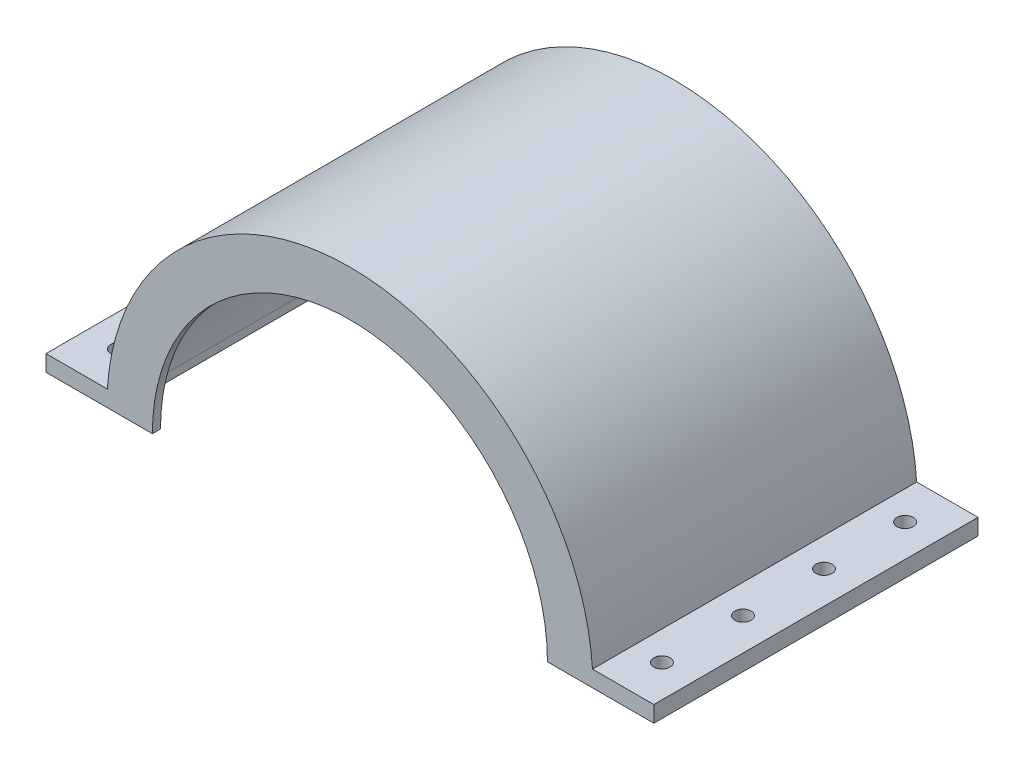
ISO-10303-21;
HEADER;
FILE_DESCRIPTION(('STEP AP214'),'2;1');
FILE_NAME('part.step','',(''),(''),'','','');
FILE_SCHEMA(('AUTOMOTIVE_DESIGN { 1 0 10303 214 1 1 1 1 }'));
ENDSEC;
DATA;
#1=APPLICATION_CONTEXT('core data for automotive mechanical design processes');
#2=APPLICATION_PROTOCOL_DEFINITION('international standard','automotive_design',2000,#1);
#3=PRODUCT_CONTEXT('',#1,'mechanical');
#4=PRODUCT('Part','Part','',(#3));
#5=PRODUCT_RELATED_PRODUCT_CATEGORY('part','',(#4));
#6=PRODUCT_DEFINITION_FORMATION('','',#4);
#7=PRODUCT_DEFINITION_CONTEXT('part definition',#1,'design');
#8=PRODUCT_DEFINITION('design','',#6,#7);
#9=PRODUCT_DEFINITION_SHAPE('','',#8);
#10=(LENGTH_UNIT() NAMED_UNIT(*) SI_UNIT(.MILLI.,.METRE.));
#11=(NAMED_UNIT(*) PLANE_ANGLE_UNIT() SI_UNIT($,.RADIAN.));
#12=(NAMED_UNIT(*) SI_UNIT($,.STERADIAN.) SOLID_ANGLE_UNIT());
#13=UNCERTAINTY_MEASURE_WITH_UNIT(LENGTH_MEASURE(1.E-05),#10,'distance_accuracy_value','');
#14=(GEOMETRIC_REPRESENTATION_CONTEXT(3) GLOBAL_UNCERTAINTY_ASSIGNED_CONTEXT((#13)) GLOBAL_UNIT_ASSIGNED_CONTEXT((#10,
#11,#12)) REPRESENTATION_CONTEXT('',''));
#15=CARTESIAN_POINT('',(0.,0.,0.));
#16=DIRECTION('',(0.,0.,1.));
#17=DIRECTION('',(1.,0.,0.));
#18=AXIS2_PLACEMENT_3D('',#15,#16,#17);
#19=CARTESIAN_POINT('',(-75.,0.,80.));
#20=DIRECTION('',(0.,1.,0.));
#21=DIRECTION('',(0.,0.,1.));
#22=AXIS2_PLACEMENT_3D('',#19,#20,#21);
#23=PLANE('',#22);
#24=CARTESIAN_POINT('',(-67.,0.,30.));
#25=DIRECTION('',(0.,1.,0.));
#26=DIRECTION('',(0.,0.,-1.));
#27=AXIS2_PLACEMENT_3D('',#24,#25,#26);
#28=CIRCLE('',#27,2.);
#29=CARTESIAN_POINT('',(-67.,0.,28.));
#30=VERTEX_POINT('',#29);
#31=EDGE_CURVE('E246',#30,#30,#28,.T.);
#32=ORIENTED_EDGE('',*,*,#31,.T.);
#33=EDGE_LOOP('',(#32));
#34=FACE_BOUND('',#33,.T.);
#35=CARTESIAN_POINT('',(-67.,0.,70.));
#36=DIRECTION('',(0.,1.,0.));
#37=DIRECTION('',(0.,0.,-1.));
#38=AXIS2_PLACEMENT_3D('',#35,#36,#37);
#39=CIRCLE('',#38,2.);
#40=CARTESIAN_POINT('',(-67.,0.,68.));
#41=VERTEX_POINT('',#40);
#42=EDGE_CURVE('E240',#41,#41,#39,.T.);
#43=ORIENTED_EDGE('',*,*,#42,.T.);
#44=EDGE_LOOP('',(#43));
#45=FACE_BOUND('',#44,.T.);
#46=DIRECTION('',(1.,0.,0.));
#47=VECTOR('',#46,1.);
#48=CARTESIAN_POINT('',(-75.,0.,0.));
#49=LINE('',#48,#47);
#50=CARTESIAN_POINT('',(-75.,0.,0.));
#51=VERTEX_POINT('',#50);
#52=CARTESIAN_POINT('',(-15.,0.,0.));
#53=VERTEX_POINT('',#52);
#54=EDGE_CURVE('E198',#51,#53,#49,.T.);
#55=ORIENTED_EDGE('',*,*,#54,.T.);
#56=DIRECTION('',(0.,0.,-1.));
#57=VECTOR('',#56,1.);
#58=CARTESIAN_POINT('',(-15.,0.,80.001));
#59=LINE('',#58,#57);
#60=CARTESIAN_POINT('',(-15.,0.,2.));
#61=VERTEX_POINT('',#60);
#62=EDGE_CURVE('E49',#61,#53,#59,.T.);
#63=ORIENTED_EDGE('',*,*,#62,.F.);
#64=DIRECTION('',(1.,0.,0.));
#65=VECTOR('',#64,1.);
#66=CARTESIAN_POINT('',(-75.,0.,2.));
#67=LINE('',#66,#65);
#68=CARTESIAN_POINT('',(-57.9655069847577,0.,2.));
#69=VERTEX_POINT('',#68);
#70=EDGE_CURVE('E154',#69,#61,#67,.T.);
#71=ORIENTED_EDGE('',*,*,#70,.F.);
#72=DIRECTION('',(0.,0.,-1.));
#73=VECTOR('',#72,1.);
#74=CARTESIAN_POINT('',(-57.9655069847577,0.,78.));
#75=LINE('',#74,#73);
#76=CARTESIAN_POINT('',(-57.9655069847577,0.,78.));
#77=VERTEX_POINT('',#76);
#78=EDGE_CURVE('E162',#77,#69,#75,.T.);
#79=ORIENTED_EDGE('',*,*,#78,.F.);
#80=DIRECTION('',(1.,0.,0.));
#81=VECTOR('',#80,1.);
#82=CARTESIAN_POINT('',(-75.,0.,78.));
#83=LINE('',#82,#81);
#84=CARTESIAN_POINT('',(-48.75,0.,78.));
#85=VERTEX_POINT('',#84);
#86=EDGE_CURVE('E172',#77,#85,#83,.T.);
#87=ORIENTED_EDGE('',*,*,#86,.T.);
#88=DIRECTION('',(0.,0.,1.));
#89=VECTOR('',#88,1.);
#90=CARTESIAN_POINT('',(-48.75,0.,-0.001000000000001));
#91=LINE('',#90,#89);
#92=CARTESIAN_POINT('',(-48.75,0.,80.));
#93=VERTEX_POINT('',#92);
#94=EDGE_CURVE('E269',#85,#93,#91,.T.);
#95=ORIENTED_EDGE('',*,*,#94,.T.);
#96=DIRECTION('',(1.,0.,0.));
#97=VECTOR('',#96,1.);
#98=CARTESIAN_POINT('',(-75.,0.,80.));
#99=LINE('',#98,#97);
#100=CARTESIAN_POINT('',(-75.,0.,80.));
#101=VERTEX_POINT('',#100);
#102=EDGE_CURVE('E182',#101,#93,#99,.T.);
#103=ORIENTED_EDGE('',*,*,#102,.F.);
#104=DIRECTION('',(0.,0.,-1.));
#105=VECTOR('',#104,1.);
#106=CARTESIAN_POINT('',(-75.,0.,80.));
#107=LINE('',#106,#105);
#108=EDGE_CURVE('E222',#101,#51,#107,.T.);
#109=ORIENTED_EDGE('',*,*,#108,.T.);
#110=EDGE_LOOP('',(#55,#63,#71,#79,#87,#95,#103,#109));
#111=FACE_BOUND('',#110,.T.);
#112=CARTESIAN_POINT('',(-67.,0.,50.));
#113=DIRECTION('',(0.,1.,0.));
#114=DIRECTION('',(0.,0.,-1.));
#115=AXIS2_PLACEMENT_3D('',#112,#113,#114);
#116=CIRCLE('',#115,2.);
#117=CARTESIAN_POINT('',(-67.,0.,48.));
#118=VERTEX_POINT('',#117);
#119=EDGE_CURVE('E243',#118,#118,#116,.T.);
#120=ORIENTED_EDGE('',*,*,#119,.T.);
#121=EDGE_LOOP('',(#120));
#122=FACE_BOUND('',#121,.T.);
#123=CARTESIAN_POINT('',(-67.,0.,10.));
#124=DIRECTION('',(0.,1.,0.));
#125=DIRECTION('',(0.,0.,-1.));
#126=AXIS2_PLACEMENT_3D('',#123,#124,#125);
#127=CIRCLE('',#126,2.);
#128=CARTESIAN_POINT('',(-67.,0.,8.00000000000001));
#129=VERTEX_POINT('',#128);
#130=EDGE_CURVE('E256',#129,#129,#127,.T.);
#131=ORIENTED_EDGE('',*,*,#130,.T.);
#132=EDGE_LOOP('',(#131));
#133=FACE_BOUND('',#132,.T.);
#134=ADVANCED_FACE('F32',(#34,#45,#111,#122,#133),#23,.F.);
#135=CARTESIAN_POINT('',(-75.,4.,80.));
#136=DIRECTION('',(0.,-1.,0.));
#137=DIRECTION('',(0.,0.,-1.));
#138=AXIS2_PLACEMENT_3D('',#135,#136,#137);
#139=PLANE('',#138);
#140=CARTESIAN_POINT('',(-67.,4.,30.));
#141=DIRECTION('',(0.,-1.,0.));
#142=DIRECTION('',(0.,0.,-1.));
#143=AXIS2_PLACEMENT_3D('',#140,#141,#142);
#144=CIRCLE('',#143,2.);
#145=CARTESIAN_POINT('',(-67.,4.,28.));
#146=VERTEX_POINT('',#145);
#147=EDGE_CURVE('E244',#146,#146,#144,.F.);
#148=ORIENTED_EDGE('',*,*,#147,.F.);
#149=EDGE_LOOP('',(#148));
#150=FACE_BOUND('',#149,.T.);
#151=CARTESIAN_POINT('',(-67.,4.,70.));
#152=DIRECTION('',(0.,-1.,0.));
#153=DIRECTION('',(0.,0.,-1.));
#154=AXIS2_PLACEMENT_3D('',#151,#152,#153);
#155=CIRCLE('',#154,2.);
#156=CARTESIAN_POINT('',(-67.,4.,68.));
#157=VERTEX_POINT('',#156);
#158=EDGE_CURVE('E236',#157,#157,#155,.F.);
#159=ORIENTED_EDGE('',*,*,#158,.F.);
#160=EDGE_LOOP('',(#159));
#161=FACE_BOUND('',#160,.T.);
#162=DIRECTION('',(-1.,0.,0.));
#163=VECTOR('',#162,1.);
#164=CARTESIAN_POINT('',(-75.,4.,0.));
#165=LINE('',#164,#163);
#166=CARTESIAN_POINT('',(-59.8665181883831,3.99999999999999,0.));
#167=VERTEX_POINT('',#166);
#168=CARTESIAN_POINT('',(-75.,4.,0.));
#169=VERTEX_POINT('',#168);
#170=EDGE_CURVE('E181',#167,#169,#165,.T.);
#171=ORIENTED_EDGE('',*,*,#170,.T.);
#172=DIRECTION('',(0.,0.,-1.));
#173=VECTOR('',#172,1.);
#174=CARTESIAN_POINT('',(-75.,4.,80.));
#175=LINE('',#174,#173);
#176=CARTESIAN_POINT('',(-75.,4.,80.));
#177=VERTEX_POINT('',#176);
#178=EDGE_CURVE('E193',#177,#169,#175,.T.);
#179=ORIENTED_EDGE('',*,*,#178,.F.);
#180=DIRECTION('',(-1.,0.,0.));
#181=VECTOR('',#180,1.);
#182=CARTESIAN_POINT('',(-75.,4.,80.));
#183=LINE('',#182,#181);
#184=CARTESIAN_POINT('',(-59.8665181883831,3.99999999999999,80.));
#185=VERTEX_POINT('',#184);
#186=EDGE_CURVE('E191',#185,#177,#183,.T.);
#187=ORIENTED_EDGE('',*,*,#186,.F.);
#188=DIRECTION('',(0.,0.,-1.));
#189=VECTOR('',#188,1.);
#190=CARTESIAN_POINT('',(-59.8665181883831,3.99999999999999,80.));
#191=LINE('',#190,#189);
#192=EDGE_CURVE('E210',#185,#167,#191,.T.);
#193=ORIENTED_EDGE('',*,*,#192,.T.);
#194=EDGE_LOOP('',(#171,#179,#187,#193));
#195=FACE_BOUND('',#194,.T.);
#196=CARTESIAN_POINT('',(-67.,4.,50.));
#197=DIRECTION('',(0.,-1.,0.));
#198=DIRECTION('',(0.,0.,-1.));
#199=AXIS2_PLACEMENT_3D('',#196,#197,#198);
#200=CIRCLE('',#199,2.);
#201=CARTESIAN_POINT('',(-67.,4.,48.));
#202=VERTEX_POINT('',#201);
#203=EDGE_CURVE('E241',#202,#202,#200,.F.);
#204=ORIENTED_EDGE('',*,*,#203,.F.);
#205=EDGE_LOOP('',(#204));
#206=FACE_BOUND('',#205,.T.);
#207=CARTESIAN_POINT('',(-67.,4.,10.));
#208=DIRECTION('',(0.,-1.,0.));
#209=DIRECTION('',(0.,0.,-1.));
#210=AXIS2_PLACEMENT_3D('',#207,#208,#209);
#211=CIRCLE('',#210,2.);
#212=CARTESIAN_POINT('',(-67.,4.,8.00000000000001));
#213=VERTEX_POINT('',#212);
#214=EDGE_CURVE('E36',#213,#213,#211,.F.);
#215=ORIENTED_EDGE('',*,*,#214,.F.);
#216=EDGE_LOOP('',(#215));
#217=FACE_BOUND('',#216,.T.);
#218=ADVANCED_FACE('F331',(#150,#161,#195,#206,#217),#139,.F.);
#219=CARTESIAN_POINT('',(67.,0.,50.));
#220=DIRECTION('',(0.,-1.,0.));
#221=DIRECTION('',(0.,0.,-1.));
#222=AXIS2_PLACEMENT_3D('',#219,#220,#221);
#223=CIRCLE('',#222,2.);
#224=CARTESIAN_POINT('',(67.,0.,48.));
#225=VERTEX_POINT('',#224);
#226=EDGE_CURVE('E239',#225,#225,#223,.T.);
#227=ORIENTED_EDGE('',*,*,#226,.F.);
#228=EDGE_LOOP('',(#227));
#229=FACE_BOUND('',#228,.T.);
#230=CARTESIAN_POINT('',(67.,0.,70.));
#231=DIRECTION('',(0.,-1.,0.));
#232=DIRECTION('',(0.,0.,-1.));
#233=AXIS2_PLACEMENT_3D('',#230,#231,#232);
#234=CIRCLE('',#233,2.);
#235=CARTESIAN_POINT('',(67.,0.,68.));
#236=VERTEX_POINT('',#235);
#237=EDGE_CURVE('E228',#236,#236,#234,.T.);
#238=ORIENTED_EDGE('',*,*,#237,.F.);
#239=EDGE_LOOP('',(#238));
#240=FACE_BOUND('',#239,.T.);
#241=CARTESIAN_POINT('',(15.,0.,2.));
#242=VERTEX_POINT('',#241);
#243=CARTESIAN_POINT('',(57.9123339376508,0.,2.));
#244=VERTEX_POINT('',#243);
#245=EDGE_CURVE('E151',#242,#244,#67,.T.);
#246=ORIENTED_EDGE('',*,*,#245,.F.);
#247=DIRECTION('',(0.,0.,-1.));
#248=VECTOR('',#247,1.);
#249=CARTESIAN_POINT('',(15.,0.,80.001));
#250=LINE('',#249,#248);
#251=CARTESIAN_POINT('',(15.,0.,0.));
#252=VERTEX_POINT('',#251);
#253=EDGE_CURVE('E139',#242,#252,#250,.T.);
#254=ORIENTED_EDGE('',*,*,#253,.T.);
#255=CARTESIAN_POINT('',(75.,0.,0.));
#256=VERTEX_POINT('',#255);
#257=EDGE_CURVE('E197',#252,#256,#49,.T.);
#258=ORIENTED_EDGE('',*,*,#257,.T.);
#259=DIRECTION('',(0.,0.,-1.));
#260=VECTOR('',#259,1.);
#261=CARTESIAN_POINT('',(75.,0.,80.));
#262=LINE('',#261,#260);
#263=CARTESIAN_POINT('',(75.,0.,80.));
#264=VERTEX_POINT('',#263);
#265=EDGE_CURVE('E219',#264,#256,#262,.T.);
#266=ORIENTED_EDGE('',*,*,#265,.F.);
#267=CARTESIAN_POINT('',(48.75,0.,80.));
#268=VERTEX_POINT('',#267);
#269=EDGE_CURVE('E180',#268,#264,#99,.T.);
#270=ORIENTED_EDGE('',*,*,#269,.F.);
#271=DIRECTION('',(0.,0.,1.));
#272=VECTOR('',#271,1.);
#273=CARTESIAN_POINT('',(48.75,0.,-0.001000000000001));
#274=LINE('',#273,#272);
#275=CARTESIAN_POINT('',(48.75,0.,78.));
#276=VERTEX_POINT('',#275);
#277=EDGE_CURVE('E57',#276,#268,#274,.T.);
#278=ORIENTED_EDGE('',*,*,#277,.F.);
#279=CARTESIAN_POINT('',(57.9123339376508,0.,78.));
#280=VERTEX_POINT('',#279);
#281=EDGE_CURVE('E176',#276,#280,#83,.T.);
#282=ORIENTED_EDGE('',*,*,#281,.T.);
#283=DIRECTION('',(0.,0.,1.));
#284=VECTOR('',#283,1.);
#285=CARTESIAN_POINT('',(57.9123339376508,0.,78.));
#286=LINE('',#285,#284);
#287=EDGE_CURVE('E160',#244,#280,#286,.T.);
#288=ORIENTED_EDGE('',*,*,#287,.F.);
#289=EDGE_LOOP('',(#246,#254,#258,#266,#270,#278,#282,#288));
#290=FACE_BOUND('',#289,.T.);
#291=CARTESIAN_POINT('',(67.,0.,30.));
#292=DIRECTION('',(0.,-1.,0.));
#293=DIRECTION('',(0.,0.,-1.));
#294=AXIS2_PLACEMENT_3D('',#291,#292,#293);
#295=CIRCLE('',#294,2.);
#296=CARTESIAN_POINT('',(67.,0.,28.));
#297=VERTEX_POINT('',#296);
#298=EDGE_CURVE('E225',#297,#297,#295,.T.);
#299=ORIENTED_EDGE('',*,*,#298,.F.);
#300=EDGE_LOOP('',(#299));
#301=FACE_BOUND('',#300,.T.);
#302=CARTESIAN_POINT('',(67.,0.,10.));
#303=DIRECTION('',(0.,-1.,0.));
#304=DIRECTION('',(0.,0.,-1.));
#305=AXIS2_PLACEMENT_3D('',#302,#303,#304);
#306=CIRCLE('',#305,2.);
#307=CARTESIAN_POINT('',(67.,0.,8.00000000000001));
#308=VERTEX_POINT('',#307);
#309=EDGE_CURVE('E41',#308,#308,#306,.T.);
#310=ORIENTED_EDGE('',*,*,#309,.F.);
#311=EDGE_LOOP('',(#310));
#312=FACE_BOUND('',#311,.T.);
#313=ADVANCED_FACE('F157',(#229,#240,#290,#301,#312),#23,.F.);
#314=CARTESIAN_POINT('',(0.,0.,78.));
#315=DIRECTION('',(0.,0.,1.));
#316=DIRECTION('',(1.,0.,0.));
#317=AXIS2_PLACEMENT_3D('',#314,#315,#316);
#318=PLANE('',#317);
#319=ORIENTED_EDGE('',*,*,#281,.F.);
#320=CARTESIAN_POINT('',(0.,0.,78.));
#321=DIRECTION('',(0.,0.,1.));
#322=DIRECTION('',(1.,0.,0.));
#323=AXIS2_PLACEMENT_3D('',#320,#321,#322);
#324=CIRCLE('',#323,48.75);
#325=EDGE_CURVE('E273',#85,#276,#324,.F.);
#326=ORIENTED_EDGE('',*,*,#325,.F.);
#327=ORIENTED_EDGE('',*,*,#86,.F.);
#328=DIRECTION('',(0.,1.,0.));
#329=VECTOR('',#328,1.);
#330=CARTESIAN_POINT('',(-57.9655069847577,-77.4831444070836,78.));
#331=LINE('',#330,#329);
#332=CARTESIAN_POINT('',(-57.9655069847577,2.,78.));
#333=VERTEX_POINT('',#332);
#334=EDGE_CURVE('E280',#77,#333,#331,.T.);
#335=ORIENTED_EDGE('',*,*,#334,.T.);
#336=CARTESIAN_POINT('',(0.,0.,78.));
#337=DIRECTION('',(0.,0.,1.));
#338=DIRECTION('',(1.,0.,0.));
#339=AXIS2_PLACEMENT_3D('',#336,#337,#338);
#340=CIRCLE('',#339,58.);
#341=CARTESIAN_POINT('',(57.9655069847577,2.,78.));
#342=VERTEX_POINT('',#341);
#343=EDGE_CURVE('E175',#342,#333,#340,.T.);
#344=ORIENTED_EDGE('',*,*,#343,.F.);
#345=DIRECTION('',(-1.,0.,0.));
#346=VECTOR('',#345,1.);
#347=CARTESIAN_POINT('',(57.9123339376508,2.,78.));
#348=LINE('',#347,#346);
#349=CARTESIAN_POINT('',(57.9123339376508,2.,78.));
#350=VERTEX_POINT('',#349);
#351=EDGE_CURVE('E287',#342,#350,#348,.T.);
#352=ORIENTED_EDGE('',*,*,#351,.T.);
#353=DIRECTION('',(0.,1.,0.));
#354=VECTOR('',#353,1.);
#355=CARTESIAN_POINT('',(57.9123339376508,-77.4831444070836,78.));
#356=LINE('',#355,#354);
#357=EDGE_CURVE('E289',#280,#350,#356,.T.);
#358=ORIENTED_EDGE('',*,*,#357,.F.);
#359=EDGE_LOOP('',(#319,#326,#327,#335,#344,#352,#358));
#360=FACE_BOUND('',#359,.T.);
#361=ADVANCED_FACE('F317',(#360),#318,.F.);
#362=CARTESIAN_POINT('',(0.,0.,2.));
#363=DIRECTION('',(0.,0.,1.));
#364=DIRECTION('',(1.,0.,0.));
#365=AXIS2_PLACEMENT_3D('',#362,#363,#364);
#366=PLANE('',#365);
#367=CARTESIAN_POINT('',(0.,0.,2.));
#368=DIRECTION('',(0.,0.,1.));
#369=DIRECTION('',(1.,0.,0.));
#370=AXIS2_PLACEMENT_3D('',#367,#368,#369);
#371=CIRCLE('',#370,15.);
#372=EDGE_CURVE('E142',#61,#242,#371,.F.);
#373=ORIENTED_EDGE('',*,*,#372,.T.);
#374=ORIENTED_EDGE('',*,*,#245,.T.);
#375=DIRECTION('',(0.,1.,0.));
#376=VECTOR('',#375,1.);
#377=CARTESIAN_POINT('',(57.9123339376508,-77.4831444070836,2.));
#378=LINE('',#377,#376);
#379=CARTESIAN_POINT('',(57.9123339376508,2.,2.));
#380=VERTEX_POINT('',#379);
#381=EDGE_CURVE('E281',#244,#380,#378,.T.);
#382=ORIENTED_EDGE('',*,*,#381,.T.);
#383=DIRECTION('',(1.,0.,0.));
#384=VECTOR('',#383,1.);
#385=CARTESIAN_POINT('',(57.9123339376508,2.,2.));
#386=LINE('',#385,#384);
#387=CARTESIAN_POINT('',(57.9655069847577,2.,2.));
#388=VERTEX_POINT('',#387);
#389=EDGE_CURVE('E284',#380,#388,#386,.T.);
#390=ORIENTED_EDGE('',*,*,#389,.T.);
#391=CARTESIAN_POINT('',(0.,0.,2.));
#392=DIRECTION('',(0.,0.,1.));
#393=DIRECTION('',(1.,0.,0.));
#394=AXIS2_PLACEMENT_3D('',#391,#392,#393);
#395=CIRCLE('',#394,58.);
#396=CARTESIAN_POINT('',(-57.9655069847577,2.,2.));
#397=VERTEX_POINT('',#396);
#398=EDGE_CURVE('E164',#388,#397,#395,.T.);
#399=ORIENTED_EDGE('',*,*,#398,.T.);
#400=DIRECTION('',(0.,1.,0.));
#401=VECTOR('',#400,1.);
#402=CARTESIAN_POINT('',(-57.9655069847577,-77.4831444070836,2.));
#403=LINE('',#402,#401);
#404=EDGE_CURVE('E166',#69,#397,#403,.T.);
#405=ORIENTED_EDGE('',*,*,#404,.F.);
#406=ORIENTED_EDGE('',*,*,#70,.T.);
#407=EDGE_LOOP('',(#373,#374,#382,#390,#399,#405,#406));
#408=FACE_BOUND('',#407,.T.);
#409=ADVANCED_FACE('F150',(#408),#366,.T.);
#410=CARTESIAN_POINT('',(-75.,0.,80.));
#411=DIRECTION('',(1.,0.,0.));
#412=DIRECTION('',(0.,0.,-1.));
#413=AXIS2_PLACEMENT_3D('',#410,#411,#412);
#414=PLANE('',#413);
#415=DIRECTION('',(0.,-1.,0.));
#416=VECTOR('',#415,1.);
#417=CARTESIAN_POINT('',(-75.,0.,0.));
#418=LINE('',#417,#416);
#419=EDGE_CURVE('E194',#169,#51,#418,.T.);
#420=ORIENTED_EDGE('',*,*,#419,.T.);
#421=ORIENTED_EDGE('',*,*,#108,.F.);
#422=DIRECTION('',(0.,-1.,0.));
#423=VECTOR('',#422,1.);
#424=CARTESIAN_POINT('',(-75.,0.,80.));
#425=LINE('',#424,#423);
#426=EDGE_CURVE('E177',#177,#101,#425,.T.);
#427=ORIENTED_EDGE('',*,*,#426,.F.);
#428=ORIENTED_EDGE('',*,*,#178,.T.);
#429=EDGE_LOOP('',(#420,#421,#427,#428));
#430=FACE_BOUND('',#429,.T.);
#431=ADVANCED_FACE('F392',(#430),#414,.F.);
#432=CARTESIAN_POINT('',(75.,0.,80.));
#433=DIRECTION('',(-1.,0.,0.));
#434=DIRECTION('',(0.,0.,1.));
#435=AXIS2_PLACEMENT_3D('',#432,#433,#434);
#436=PLANE('',#435);
#437=DIRECTION('',(0.,1.,0.));
#438=VECTOR('',#437,1.);
#439=CARTESIAN_POINT('',(75.,0.,0.));
#440=LINE('',#439,#438);
#441=CARTESIAN_POINT('',(75.,4.,0.));
#442=VERTEX_POINT('',#441);
#443=EDGE_CURVE('E201',#256,#442,#440,.T.);
#444=ORIENTED_EDGE('',*,*,#443,.T.);
#445=DIRECTION('',(0.,0.,-1.));
#446=VECTOR('',#445,1.);
#447=CARTESIAN_POINT('',(75.,4.,80.));
#448=LINE('',#447,#446);
#449=CARTESIAN_POINT('',(75.,4.,80.));
#450=VERTEX_POINT('',#449);
#451=EDGE_CURVE('E216',#450,#442,#448,.T.);
#452=ORIENTED_EDGE('',*,*,#451,.F.);
#453=DIRECTION('',(0.,1.,0.));
#454=VECTOR('',#453,1.);
#455=CARTESIAN_POINT('',(75.,0.,80.));
#456=LINE('',#455,#454);
#457=EDGE_CURVE('E185',#264,#450,#456,.T.);
#458=ORIENTED_EDGE('',*,*,#457,.F.);
#459=ORIENTED_EDGE('',*,*,#265,.T.);
#460=EDGE_LOOP('',(#444,#452,#458,#459));
#461=FACE_BOUND('',#460,.T.);
#462=ADVANCED_FACE('F362',(#461),#436,.F.);
#463=CARTESIAN_POINT('',(75.,4.,80.));
#464=DIRECTION('',(0.,-1.,0.));
#465=DIRECTION('',(0.,0.,-1.));
#466=AXIS2_PLACEMENT_3D('',#463,#464,#465);
#467=PLANE('',#466);
#468=CARTESIAN_POINT('',(67.,4.,50.));
#469=DIRECTION('',(0.,-1.,0.));
#470=DIRECTION('',(0.,0.,-1.));
#471=AXIS2_PLACEMENT_3D('',#468,#469,#470);
#472=CIRCLE('',#471,2.);
#473=CARTESIAN_POINT('',(67.,4.,48.));
#474=VERTEX_POINT('',#473);
#475=EDGE_CURVE('E263',#474,#474,#472,.T.);
#476=ORIENTED_EDGE('',*,*,#475,.T.);
#477=EDGE_LOOP('',(#476));
#478=FACE_BOUND('',#477,.T.);
#479=CARTESIAN_POINT('',(67.,4.,70.));
#480=DIRECTION('',(0.,-1.,0.));
#481=DIRECTION('',(0.,0.,-1.));
#482=AXIS2_PLACEMENT_3D('',#479,#480,#481);
#483=CIRCLE('',#482,2.);
#484=CARTESIAN_POINT('',(67.,4.,68.));
#485=VERTEX_POINT('',#484);
#486=EDGE_CURVE('E155',#485,#485,#483,.T.);
#487=ORIENTED_EDGE('',*,*,#486,.T.);
#488=EDGE_LOOP('',(#487));
#489=FACE_BOUND('',#488,.T.);
#490=DIRECTION('',(-1.,0.,0.));
#491=VECTOR('',#490,1.);
#492=CARTESIAN_POINT('',(75.,4.,0.));
#493=LINE('',#492,#491);
#494=CARTESIAN_POINT('',(59.8665181883831,4.,0.));
#495=VERTEX_POINT('',#494);
#496=EDGE_CURVE('E203',#442,#495,#493,.T.);
#497=ORIENTED_EDGE('',*,*,#496,.T.);
#498=DIRECTION('',(0.,0.,-1.));
#499=VECTOR('',#498,1.);
#500=CARTESIAN_POINT('',(59.8665181883831,4.,80.));
#501=LINE('',#500,#499);
#502=CARTESIAN_POINT('',(59.8665181883831,4.,80.));
#503=VERTEX_POINT('',#502);
#504=EDGE_CURVE('E213',#503,#495,#501,.T.);
#505=ORIENTED_EDGE('',*,*,#504,.F.);
#506=DIRECTION('',(-1.,0.,0.));
#507=VECTOR('',#506,1.);
#508=CARTESIAN_POINT('',(75.,4.,80.));
#509=LINE('',#508,#507);
#510=EDGE_CURVE('E187',#450,#503,#509,.T.);
#511=ORIENTED_EDGE('',*,*,#510,.F.);
#512=ORIENTED_EDGE('',*,*,#451,.T.);
#513=EDGE_LOOP('',(#497,#505,#511,#512));
#514=FACE_BOUND('',#513,.T.);
#515=CARTESIAN_POINT('',(67.,4.,30.));
#516=DIRECTION('',(0.,-1.,0.));
#517=DIRECTION('',(0.,0.,-1.));
#518=AXIS2_PLACEMENT_3D('',#515,#516,#517);
#519=CIRCLE('',#518,2.);
#520=CARTESIAN_POINT('',(67.,4.,28.));
#521=VERTEX_POINT('',#520);
#522=EDGE_CURVE('E231',#521,#521,#519,.T.);
#523=ORIENTED_EDGE('',*,*,#522,.T.);
#524=EDGE_LOOP('',(#523));
#525=FACE_BOUND('',#524,.T.);
#526=CARTESIAN_POINT('',(67.,4.,10.));
#527=DIRECTION('',(0.,-1.,0.));
#528=DIRECTION('',(0.,0.,-1.));
#529=AXIS2_PLACEMENT_3D('',#526,#527,#528);
#530=CIRCLE('',#529,2.);
#531=CARTESIAN_POINT('',(67.,4.,8.00000000000001));
#532=VERTEX_POINT('',#531);
#533=EDGE_CURVE('E11',#532,#532,#530,.T.);
#534=ORIENTED_EDGE('',*,*,#533,.T.);
#535=EDGE_LOOP('',(#534));
#536=FACE_BOUND('',#535,.T.);
#537=ADVANCED_FACE('F358',(#478,#489,#514,#525,#536),#467,.F.);
#538=CARTESIAN_POINT('',(0.,0.,80.));
#539=DIRECTION('',(0.,0.,-1.));
#540=DIRECTION('',(-1.,0.,0.));
#541=AXIS2_PLACEMENT_3D('',#538,#539,#540);
#542=CYLINDRICAL_SURFACE('',#541,60.);
#543=CARTESIAN_POINT('',(0.,0.,0.));
#544=DIRECTION('',(0.,0.,1.));
#545=DIRECTION('',(1.,0.,0.));
#546=AXIS2_PLACEMENT_3D('',#543,#544,#545);
#547=CIRCLE('',#546,60.);
#548=EDGE_CURVE('E205',#495,#167,#547,.T.);
#549=ORIENTED_EDGE('',*,*,#548,.T.);
#550=ORIENTED_EDGE('',*,*,#192,.F.);
#551=CARTESIAN_POINT('',(0.,0.,80.));
#552=DIRECTION('',(0.,0.,1.));
#553=DIRECTION('',(1.,0.,0.));
#554=AXIS2_PLACEMENT_3D('',#551,#552,#553);
#555=CIRCLE('',#554,60.);
#556=EDGE_CURVE('E189',#503,#185,#555,.T.);
#557=ORIENTED_EDGE('',*,*,#556,.F.);
#558=ORIENTED_EDGE('',*,*,#504,.T.);
#559=EDGE_LOOP('',(#549,#550,#557,#558));
#560=FACE_BOUND('',#559,.T.);
#561=ADVANCED_FACE('F361',(#560),#542,.T.);
#562=CARTESIAN_POINT('',(0.,0.,80.));
#563=DIRECTION('',(0.,0.,1.));
#564=DIRECTION('',(1.,0.,0.));
#565=AXIS2_PLACEMENT_3D('',#562,#563,#564);
#566=PLANE('',#565);
#567=CARTESIAN_POINT('',(0.,0.,80.));
#568=DIRECTION('',(0.,0.,1.));
#569=DIRECTION('',(1.,0.,0.));
#570=AXIS2_PLACEMENT_3D('',#567,#568,#569);
#571=CIRCLE('',#570,48.75);
#572=EDGE_CURVE('E271',#268,#93,#571,.T.);
#573=ORIENTED_EDGE('',*,*,#572,.F.);
#574=ORIENTED_EDGE('',*,*,#269,.T.);
#575=ORIENTED_EDGE('',*,*,#457,.T.);
#576=ORIENTED_EDGE('',*,*,#510,.T.);
#577=ORIENTED_EDGE('',*,*,#556,.T.);
#578=ORIENTED_EDGE('',*,*,#186,.T.);
#579=ORIENTED_EDGE('',*,*,#426,.T.);
#580=ORIENTED_EDGE('',*,*,#102,.T.);
#581=EDGE_LOOP('',(#573,#574,#575,#576,#577,#578,#579,#580));
#582=FACE_BOUND('',#581,.T.);
#583=ADVANCED_FACE('F412',(#582),#566,.T.);
#584=CARTESIAN_POINT('',(0.,0.,0.));
#585=DIRECTION('',(0.,0.,1.));
#586=DIRECTION('',(1.,0.,0.));
#587=AXIS2_PLACEMENT_3D('',#584,#585,#586);
#588=PLANE('',#587);
#589=ORIENTED_EDGE('',*,*,#257,.F.);
#590=CARTESIAN_POINT('',(0.,0.,0.));
#591=DIRECTION('',(0.,0.,-1.));
#592=DIRECTION('',(-1.,0.,0.));
#593=AXIS2_PLACEMENT_3D('',#590,#591,#592);
#594=CIRCLE('',#593,15.);
#595=EDGE_CURVE('E143',#53,#252,#594,.T.);
#596=ORIENTED_EDGE('',*,*,#595,.F.);
#597=ORIENTED_EDGE('',*,*,#54,.F.);
#598=ORIENTED_EDGE('',*,*,#419,.F.);
#599=ORIENTED_EDGE('',*,*,#170,.F.);
#600=ORIENTED_EDGE('',*,*,#548,.F.);
#601=ORIENTED_EDGE('',*,*,#496,.F.);
#602=ORIENTED_EDGE('',*,*,#443,.F.);
#603=EDGE_LOOP('',(#589,#596,#597,#598,#599,#600,#601,#602));
#604=FACE_BOUND('',#603,.T.);
#605=ADVANCED_FACE('F407',(#604),#588,.F.);
#606=CARTESIAN_POINT('',(0.,0.,80.));
#607=DIRECTION('',(0.,0.,-1.));
#608=DIRECTION('',(-1.,0.,0.));
#609=AXIS2_PLACEMENT_3D('',#606,#607,#608);
#610=CYLINDRICAL_SURFACE('',#609,58.);
#611=ORIENTED_EDGE('',*,*,#398,.F.);
#612=DIRECTION('',(0.,0.,-1.));
#613=VECTOR('',#612,1.);
#614=CARTESIAN_POINT('',(57.9655069847577,2.,78.));
#615=LINE('',#614,#613);
#616=EDGE_CURVE('E170',#342,#388,#615,.T.);
#617=ORIENTED_EDGE('',*,*,#616,.F.);
#618=ORIENTED_EDGE('',*,*,#343,.T.);
#619=DIRECTION('',(0.,0.,-1.));
#620=VECTOR('',#619,1.);
#621=CARTESIAN_POINT('',(-57.9655069847577,2.,78.));
#622=LINE('',#621,#620);
#623=EDGE_CURVE('E296',#333,#397,#622,.T.);
#624=ORIENTED_EDGE('',*,*,#623,.T.);
#625=EDGE_LOOP('',(#611,#617,#618,#624));
#626=FACE_BOUND('',#625,.T.);
#627=ADVANCED_FACE('F303',(#626),#610,.F.);
#628=CARTESIAN_POINT('',(-57.9655069847577,-77.4831444070836,78.));
#629=DIRECTION('',(-1.,0.,0.));
#630=DIRECTION('',(0.,0.,1.));
#631=AXIS2_PLACEMENT_3D('',#628,#629,#630);
#632=PLANE('',#631);
#633=ORIENTED_EDGE('',*,*,#334,.F.);
#634=ORIENTED_EDGE('',*,*,#78,.T.);
#635=ORIENTED_EDGE('',*,*,#404,.T.);
#636=ORIENTED_EDGE('',*,*,#623,.F.);
#637=EDGE_LOOP('',(#633,#634,#635,#636));
#638=FACE_BOUND('',#637,.T.);
#639=ADVANCED_FACE('F309',(#638),#632,.F.);
#640=CARTESIAN_POINT('',(57.9123339376508,2.,2.));
#641=DIRECTION('',(0.,-1.,0.));
#642=DIRECTION('',(0.,0.,-1.));
#643=AXIS2_PLACEMENT_3D('',#640,#641,#642);
#644=PLANE('',#643);
#645=ORIENTED_EDGE('',*,*,#616,.T.);
#646=ORIENTED_EDGE('',*,*,#389,.F.);
#647=DIRECTION('',(0.,0.,-1.));
#648=VECTOR('',#647,1.);
#649=CARTESIAN_POINT('',(57.9123339376508,2.,78.));
#650=LINE('',#649,#648);
#651=EDGE_CURVE('E275',#350,#380,#650,.T.);
#652=ORIENTED_EDGE('',*,*,#651,.F.);
#653=ORIENTED_EDGE('',*,*,#351,.F.);
#654=EDGE_LOOP('',(#645,#646,#652,#653));
#655=FACE_BOUND('',#654,.T.);
#656=ADVANCED_FACE('F314',(#655),#644,.F.);
#657=CARTESIAN_POINT('',(57.9123339376508,-77.4831444070836,78.));
#658=DIRECTION('',(1.,0.,0.));
#659=DIRECTION('',(0.,0.,-1.));
#660=AXIS2_PLACEMENT_3D('',#657,#658,#659);
#661=PLANE('',#660);
#662=ORIENTED_EDGE('',*,*,#381,.F.);
#663=ORIENTED_EDGE('',*,*,#287,.T.);
#664=ORIENTED_EDGE('',*,*,#357,.T.);
#665=ORIENTED_EDGE('',*,*,#651,.T.);
#666=EDGE_LOOP('',(#662,#663,#664,#665));
#667=FACE_BOUND('',#666,.T.);
#668=ADVANCED_FACE('F319',(#667),#661,.F.);
#669=CARTESIAN_POINT('',(0.,0.,-0.001000000000001));
#670=DIRECTION('',(0.,0.,1.));
#671=DIRECTION('',(1.,0.,0.));
#672=AXIS2_PLACEMENT_3D('',#669,#670,#671);
#673=CYLINDRICAL_SURFACE('',#672,48.75);
#674=ORIENTED_EDGE('',*,*,#325,.T.);
#675=ORIENTED_EDGE('',*,*,#277,.T.);
#676=ORIENTED_EDGE('',*,*,#572,.T.);
#677=ORIENTED_EDGE('',*,*,#94,.F.);
#678=EDGE_LOOP('',(#674,#675,#676,#677));
#679=FACE_BOUND('',#678,.T.);
#680=ADVANCED_FACE('F321',(#679),#673,.F.);
#681=CARTESIAN_POINT('',(0.,0.,80.001));
#682=DIRECTION('',(0.,0.,-1.));
#683=DIRECTION('',(-1.,0.,0.));
#684=AXIS2_PLACEMENT_3D('',#681,#682,#683);
#685=CYLINDRICAL_SURFACE('',#684,15.);
#686=ORIENTED_EDGE('',*,*,#62,.T.);
#687=ORIENTED_EDGE('',*,*,#595,.T.);
#688=ORIENTED_EDGE('',*,*,#253,.F.);
#689=ORIENTED_EDGE('',*,*,#372,.F.);
#690=EDGE_LOOP('',(#686,#687,#688,#689));
#691=FACE_BOUND('',#690,.T.);
#692=ADVANCED_FACE('F141',(#691),#685,.F.);
#693=CARTESIAN_POINT('',(67.,60.,70.));
#694=DIRECTION('',(0.,-1.,0.));
#695=DIRECTION('',(0.,0.,-1.));
#696=AXIS2_PLACEMENT_3D('',#693,#694,#695);
#697=CYLINDRICAL_SURFACE('',#696,2.);
#698=ORIENTED_EDGE('',*,*,#237,.T.);
#699=EDGE_LOOP('',(#698));
#700=FACE_BOUND('',#699,.T.);
#701=ORIENTED_EDGE('',*,*,#486,.F.);
#702=EDGE_LOOP('',(#701));
#703=FACE_BOUND('',#702,.T.);
#704=ADVANCED_FACE('F351',(#700,#703),#697,.F.);
#705=CARTESIAN_POINT('',(67.,60.,50.));
#706=DIRECTION('',(0.,-1.,0.));
#707=DIRECTION('',(0.,0.,-1.));
#708=AXIS2_PLACEMENT_3D('',#705,#706,#707);
#709=CYLINDRICAL_SURFACE('',#708,2.);
#710=ORIENTED_EDGE('',*,*,#226,.T.);
#711=EDGE_LOOP('',(#710));
#712=FACE_BOUND('',#711,.T.);
#713=ORIENTED_EDGE('',*,*,#475,.F.);
#714=EDGE_LOOP('',(#713));
#715=FACE_BOUND('',#714,.T.);
#716=ADVANCED_FACE('F354',(#712,#715),#709,.F.);
#717=CARTESIAN_POINT('',(67.,60.,30.));
#718=DIRECTION('',(0.,-1.,0.));
#719=DIRECTION('',(0.,0.,-1.));
#720=AXIS2_PLACEMENT_3D('',#717,#718,#719);
#721=CYLINDRICAL_SURFACE('',#720,2.);
#722=ORIENTED_EDGE('',*,*,#298,.T.);
#723=EDGE_LOOP('',(#722));
#724=FACE_BOUND('',#723,.T.);
#725=ORIENTED_EDGE('',*,*,#522,.F.);
#726=EDGE_LOOP('',(#725));
#727=FACE_BOUND('',#726,.T.);
#728=ADVANCED_FACE('F374',(#724,#727),#721,.F.);
#729=CARTESIAN_POINT('',(67.,60.,10.));
#730=DIRECTION('',(0.,-1.,0.));
#731=DIRECTION('',(0.,0.,-1.));
#732=AXIS2_PLACEMENT_3D('',#729,#730,#731);
#733=CYLINDRICAL_SURFACE('',#732,2.);
#734=ORIENTED_EDGE('',*,*,#309,.T.);
#735=EDGE_LOOP('',(#734));
#736=FACE_BOUND('',#735,.T.);
#737=ORIENTED_EDGE('',*,*,#533,.F.);
#738=EDGE_LOOP('',(#737));
#739=FACE_BOUND('',#738,.T.);
#740=ADVANCED_FACE('F34',(#736,#739),#733,.F.);
#741=CARTESIAN_POINT('',(-67.,60.,70.));
#742=DIRECTION('',(0.,-1.,0.));
#743=DIRECTION('',(0.,0.,-1.));
#744=AXIS2_PLACEMENT_3D('',#741,#742,#743);
#745=CYLINDRICAL_SURFACE('',#744,2.);
#746=ORIENTED_EDGE('',*,*,#42,.F.);
#747=EDGE_LOOP('',(#746));
#748=FACE_BOUND('',#747,.T.);
#749=ORIENTED_EDGE('',*,*,#158,.T.);
#750=EDGE_LOOP('',(#749));
#751=FACE_BOUND('',#750,.T.);
#752=ADVANCED_FACE('F373',(#748,#751),#745,.F.);
#753=CARTESIAN_POINT('',(-67.,60.,50.));
#754=DIRECTION('',(0.,-1.,0.));
#755=DIRECTION('',(0.,0.,-1.));
#756=AXIS2_PLACEMENT_3D('',#753,#754,#755);
#757=CYLINDRICAL_SURFACE('',#756,2.);
#758=ORIENTED_EDGE('',*,*,#119,.F.);
#759=EDGE_LOOP('',(#758));
#760=FACE_BOUND('',#759,.T.);
#761=ORIENTED_EDGE('',*,*,#203,.T.);
#762=EDGE_LOOP('',(#761));
#763=FACE_BOUND('',#762,.T.);
#764=ADVANCED_FACE('F380',(#760,#763),#757,.F.);
#765=CARTESIAN_POINT('',(-67.,60.,30.));
#766=DIRECTION('',(0.,-1.,0.));
#767=DIRECTION('',(0.,0.,-1.));
#768=AXIS2_PLACEMENT_3D('',#765,#766,#767);
#769=CYLINDRICAL_SURFACE('',#768,2.);
#770=ORIENTED_EDGE('',*,*,#31,.F.);
#771=EDGE_LOOP('',(#770));
#772=FACE_BOUND('',#771,.T.);
#773=ORIENTED_EDGE('',*,*,#147,.T.);
#774=EDGE_LOOP('',(#773));
#775=FACE_BOUND('',#774,.T.);
#776=ADVANCED_FACE('F549',(#772,#775),#769,.F.);
#777=CARTESIAN_POINT('',(-67.,60.,10.));
#778=DIRECTION('',(0.,-1.,0.));
#779=DIRECTION('',(0.,0.,-1.));
#780=AXIS2_PLACEMENT_3D('',#777,#778,#779);
#781=CYLINDRICAL_SURFACE('',#780,2.);
#782=ORIENTED_EDGE('',*,*,#130,.F.);
#783=EDGE_LOOP('',(#782));
#784=FACE_BOUND('',#783,.T.);
#785=ORIENTED_EDGE('',*,*,#214,.T.);
#786=EDGE_LOOP('',(#785));
#787=FACE_BOUND('',#786,.T.);
#788=ADVANCED_FACE('F559',(#784,#787),#781,.F.);
#789=CLOSED_SHELL('',(#134,#218,#313,#361,#409,#431,#462,#537,#561,#583,#605,#627,#639,#656,
#668,#680,#692,#704,#716,#728,#740,#752,#764,#776,#788));
#790=MANIFOLD_SOLID_BREP('B2',#789);
#791=ADVANCED_BREP_SHAPE_REPRESENTATION('',(#18,#790),#14);
#792=SHAPE_DEFINITION_REPRESENTATION(#9,#791);
ENDSEC;
END-ISO-10303-21;
